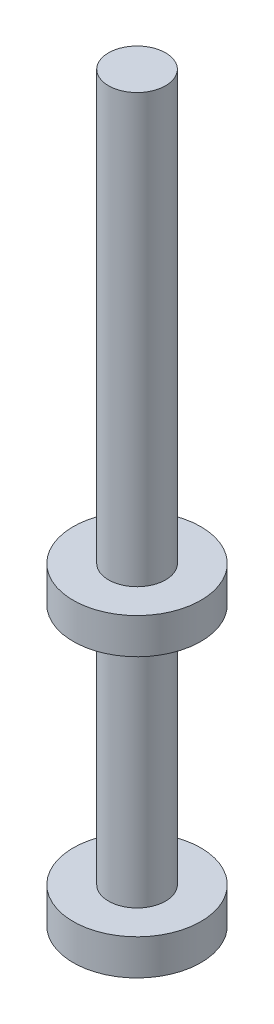
ISO-10303-21;
HEADER;
FILE_DESCRIPTION(('STEP AP214'),'2;1');
FILE_NAME('part.step','',(''),(''),'','','');
FILE_SCHEMA(('AUTOMOTIVE_DESIGN { 1 0 10303 214 1 1 1 1 }'));
ENDSEC;
DATA;
#1=APPLICATION_CONTEXT('core data for automotive mechanical design processes');
#2=APPLICATION_PROTOCOL_DEFINITION('international standard','automotive_design',2000,#1);
#3=PRODUCT_CONTEXT('',#1,'mechanical');
#4=PRODUCT('Part','Part','',(#3));
#5=PRODUCT_RELATED_PRODUCT_CATEGORY('part','',(#4));
#6=PRODUCT_DEFINITION_FORMATION('','',#4);
#7=PRODUCT_DEFINITION_CONTEXT('part definition',#1,'design');
#8=PRODUCT_DEFINITION('design','',#6,#7);
#9=PRODUCT_DEFINITION_SHAPE('','',#8);
#10=(LENGTH_UNIT() NAMED_UNIT(*) SI_UNIT(.MILLI.,.METRE.));
#11=(NAMED_UNIT(*) PLANE_ANGLE_UNIT() SI_UNIT($,.RADIAN.));
#12=(NAMED_UNIT(*) SI_UNIT($,.STERADIAN.) SOLID_ANGLE_UNIT());
#13=UNCERTAINTY_MEASURE_WITH_UNIT(LENGTH_MEASURE(1.E-05),#10,'distance_accuracy_value','');
#14=(GEOMETRIC_REPRESENTATION_CONTEXT(3) GLOBAL_UNCERTAINTY_ASSIGNED_CONTEXT((#13)) GLOBAL_UNIT_ASSIGNED_CONTEXT((#10,
#11,#12)) REPRESENTATION_CONTEXT('',''));
#15=CARTESIAN_POINT('',(0.,0.,0.));
#16=DIRECTION('',(0.,0.,1.));
#17=DIRECTION('',(1.,0.,0.));
#18=AXIS2_PLACEMENT_3D('',#15,#16,#17);
#19=CARTESIAN_POINT('',(0.,75.,0.));
#20=DIRECTION('',(0.,1.,0.));
#21=DIRECTION('',(0.,0.,1.));
#22=AXIS2_PLACEMENT_3D('',#19,#20,#21);
#23=PLANE('',#22);
#24=CARTESIAN_POINT('',(0.,75.,0.));
#25=DIRECTION('',(0.,-1.,0.));
#26=DIRECTION('',(0.,0.,-1.));
#27=AXIS2_PLACEMENT_3D('',#24,#25,#26);
#28=CIRCLE('',#27,3.99999999999999);
#29=CARTESIAN_POINT('',(0.,75.,-3.99999999999999));
#30=VERTEX_POINT('',#29);
#31=EDGE_CURVE('E10',#30,#30,#28,.T.);
#32=ORIENTED_EDGE('',*,*,#31,.F.);
#33=EDGE_LOOP('',(#32));
#34=FACE_BOUND('',#33,.T.);
#35=ADVANCED_FACE('F31',(#34),#23,.T.);
#36=CARTESIAN_POINT('',(0.,0.,0.));
#37=DIRECTION('',(0.,-1.,0.));
#38=DIRECTION('',(0.,0.,-1.));
#39=AXIS2_PLACEMENT_3D('',#36,#37,#38);
#40=CYLINDRICAL_SURFACE('',#39,4.);
#41=ORIENTED_EDGE('',*,*,#31,.T.);
#42=EDGE_LOOP('',(#41));
#43=FACE_BOUND('',#42,.T.);
#44=CARTESIAN_POINT('',(0.,15.,0.));
#45=DIRECTION('',(0.,-1.,0.));
#46=DIRECTION('',(0.,0.,-1.));
#47=AXIS2_PLACEMENT_3D('',#44,#45,#46);
#48=CIRCLE('',#47,4.);
#49=CARTESIAN_POINT('',(0.,15.,-4.));
#50=VERTEX_POINT('',#49);
#51=EDGE_CURVE('E37',#50,#50,#48,.T.);
#52=ORIENTED_EDGE('',*,*,#51,.F.);
#53=EDGE_LOOP('',(#52));
#54=FACE_BOUND('',#53,.T.);
#55=ADVANCED_FACE('F85',(#43,#54),#40,.T.);
#56=CARTESIAN_POINT('',(4.,15.,0.));
#57=DIRECTION('',(0.,1.,0.));
#58=DIRECTION('',(0.,0.,1.));
#59=AXIS2_PLACEMENT_3D('',#56,#57,#58);
#60=PLANE('',#59);
#61=ORIENTED_EDGE('',*,*,#51,.T.);
#62=EDGE_LOOP('',(#61));
#63=FACE_BOUND('',#62,.T.);
#64=CARTESIAN_POINT('',(0.,15.,0.));
#65=DIRECTION('',(0.,-1.,0.));
#66=DIRECTION('',(0.,0.,-1.));
#67=AXIS2_PLACEMENT_3D('',#64,#65,#66);
#68=CIRCLE('',#67,8.95);
#69=CARTESIAN_POINT('',(0.,15.,-8.95));
#70=VERTEX_POINT('',#69);
#71=EDGE_CURVE('E41',#70,#70,#68,.T.);
#72=ORIENTED_EDGE('',*,*,#71,.F.);
#73=EDGE_LOOP('',(#72));
#74=FACE_BOUND('',#73,.T.);
#75=ADVANCED_FACE('F90',(#63,#74),#60,.T.);
#76=CARTESIAN_POINT('',(0.,0.,0.));
#77=DIRECTION('',(0.,-1.,0.));
#78=DIRECTION('',(0.,0.,-1.));
#79=AXIS2_PLACEMENT_3D('',#76,#77,#78);
#80=CYLINDRICAL_SURFACE('',#79,8.95);
#81=ORIENTED_EDGE('',*,*,#71,.T.);
#82=EDGE_LOOP('',(#81));
#83=FACE_BOUND('',#82,.T.);
#84=CARTESIAN_POINT('',(0.,10.,0.));
#85=DIRECTION('',(0.,-1.,0.));
#86=DIRECTION('',(0.,0.,-1.));
#87=AXIS2_PLACEMENT_3D('',#84,#85,#86);
#88=CIRCLE('',#87,8.95);
#89=CARTESIAN_POINT('',(0.,10.,-8.95));
#90=VERTEX_POINT('',#89);
#91=EDGE_CURVE('E45',#90,#90,#88,.T.);
#92=ORIENTED_EDGE('',*,*,#91,.F.);
#93=EDGE_LOOP('',(#92));
#94=FACE_BOUND('',#93,.T.);
#95=ADVANCED_FACE('F94',(#83,#94),#80,.T.);
#96=CARTESIAN_POINT('',(8.95,10.,0.));
#97=DIRECTION('',(0.,-1.,0.));
#98=DIRECTION('',(0.,0.,-1.));
#99=AXIS2_PLACEMENT_3D('',#96,#97,#98);
#100=PLANE('',#99);
#101=ORIENTED_EDGE('',*,*,#91,.T.);
#102=EDGE_LOOP('',(#101));
#103=FACE_BOUND('',#102,.T.);
#104=CARTESIAN_POINT('',(0.,10.,0.));
#105=DIRECTION('',(0.,-1.,0.));
#106=DIRECTION('',(0.,0.,-1.));
#107=AXIS2_PLACEMENT_3D('',#104,#105,#106);
#108=CIRCLE('',#107,4.);
#109=CARTESIAN_POINT('',(0.,10.,-4.));
#110=VERTEX_POINT('',#109);
#111=EDGE_CURVE('E50',#110,#110,#108,.T.);
#112=ORIENTED_EDGE('',*,*,#111,.F.);
#113=EDGE_LOOP('',(#112));
#114=FACE_BOUND('',#113,.T.);
#115=ADVANCED_FACE('F100',(#103,#114),#100,.T.);
#116=CARTESIAN_POINT('',(0.,0.,0.));
#117=DIRECTION('',(0.,-1.,0.));
#118=DIRECTION('',(0.,0.,-1.));
#119=AXIS2_PLACEMENT_3D('',#116,#117,#118);
#120=CYLINDRICAL_SURFACE('',#119,4.);
#121=ORIENTED_EDGE('',*,*,#111,.T.);
#122=EDGE_LOOP('',(#121));
#123=FACE_BOUND('',#122,.T.);
#124=CARTESIAN_POINT('',(0.,-24.,0.));
#125=DIRECTION('',(0.,-1.,0.));
#126=DIRECTION('',(0.,0.,-1.));
#127=AXIS2_PLACEMENT_3D('',#124,#125,#126);
#128=CIRCLE('',#127,4.);
#129=CARTESIAN_POINT('',(0.,-24.,-4.));
#130=VERTEX_POINT('',#129);
#131=EDGE_CURVE('E53',#130,#130,#128,.T.);
#132=ORIENTED_EDGE('',*,*,#131,.F.);
#133=EDGE_LOOP('',(#132));
#134=FACE_BOUND('',#133,.T.);
#135=ADVANCED_FACE('F104',(#123,#134),#120,.T.);
#136=CARTESIAN_POINT('',(4.,-24.,0.));
#137=DIRECTION('',(0.,1.,0.));
#138=DIRECTION('',(0.,0.,1.));
#139=AXIS2_PLACEMENT_3D('',#136,#137,#138);
#140=PLANE('',#139);
#141=ORIENTED_EDGE('',*,*,#131,.T.);
#142=EDGE_LOOP('',(#141));
#143=FACE_BOUND('',#142,.T.);
#144=CARTESIAN_POINT('',(0.,-24.,0.));
#145=DIRECTION('',(0.,-1.,0.));
#146=DIRECTION('',(0.,0.,-1.));
#147=AXIS2_PLACEMENT_3D('',#144,#145,#146);
#148=CIRCLE('',#147,8.95);
#149=CARTESIAN_POINT('',(0.,-24.,-8.95));
#150=VERTEX_POINT('',#149);
#151=EDGE_CURVE('E56',#150,#150,#148,.T.);
#152=ORIENTED_EDGE('',*,*,#151,.F.);
#153=EDGE_LOOP('',(#152));
#154=FACE_BOUND('',#153,.T.);
#155=ADVANCED_FACE('F108',(#143,#154),#140,.T.);
#156=CARTESIAN_POINT('',(0.,0.,0.));
#157=DIRECTION('',(0.,-1.,0.));
#158=DIRECTION('',(0.,0.,-1.));
#159=AXIS2_PLACEMENT_3D('',#156,#157,#158);
#160=CYLINDRICAL_SURFACE('',#159,8.95);
#161=ORIENTED_EDGE('',*,*,#151,.T.);
#162=EDGE_LOOP('',(#161));
#163=FACE_BOUND('',#162,.T.);
#164=CARTESIAN_POINT('',(0.,-29.,0.));
#165=DIRECTION('',(0.,-1.,0.));
#166=DIRECTION('',(0.,0.,-1.));
#167=AXIS2_PLACEMENT_3D('',#164,#165,#166);
#168=CIRCLE('',#167,8.95);
#169=CARTESIAN_POINT('',(0.,-29.,-8.95));
#170=VERTEX_POINT('',#169);
#171=EDGE_CURVE('E59',#170,#170,#168,.T.);
#172=ORIENTED_EDGE('',*,*,#171,.F.);
#173=EDGE_LOOP('',(#172));
#174=FACE_BOUND('',#173,.T.);
#175=ADVANCED_FACE('F81',(#163,#174),#160,.T.);
#176=CARTESIAN_POINT('',(8.95,-29.,0.));
#177=DIRECTION('',(0.,-1.,0.));
#178=DIRECTION('',(0.,0.,-1.));
#179=AXIS2_PLACEMENT_3D('',#176,#177,#178);
#180=PLANE('',#179);
#181=ORIENTED_EDGE('',*,*,#171,.T.);
#182=EDGE_LOOP('',(#181));
#183=FACE_BOUND('',#182,.T.);
#184=CARTESIAN_POINT('',(0.,-29.,0.));
#185=DIRECTION('',(0.,-1.,0.));
#186=DIRECTION('',(0.,0.,-1.));
#187=AXIS2_PLACEMENT_3D('',#184,#185,#186);
#188=CIRCLE('',#187,4.);
#189=CARTESIAN_POINT('',(0.,-29.,-4.));
#190=VERTEX_POINT('',#189);
#191=EDGE_CURVE('E62',#190,#190,#188,.T.);
#192=ORIENTED_EDGE('',*,*,#191,.F.);
#193=EDGE_LOOP('',(#192));
#194=FACE_BOUND('',#193,.T.);
#195=ADVANCED_FACE('F73',(#183,#194),#180,.T.);
#196=CARTESIAN_POINT('',(0.,0.,0.));
#197=DIRECTION('',(0.,-1.,0.));
#198=DIRECTION('',(0.,0.,-1.));
#199=AXIS2_PLACEMENT_3D('',#196,#197,#198);
#200=CYLINDRICAL_SURFACE('',#199,4.00000000000001);
#201=ORIENTED_EDGE('',*,*,#191,.T.);
#202=EDGE_LOOP('',(#201));
#203=FACE_BOUND('',#202,.T.);
#204=CARTESIAN_POINT('',(0.,-31.,0.));
#205=DIRECTION('',(0.,-1.,0.));
#206=DIRECTION('',(0.,0.,-1.));
#207=AXIS2_PLACEMENT_3D('',#204,#205,#206);
#208=CIRCLE('',#207,4.00000000000001);
#209=CARTESIAN_POINT('',(0.,-31.,-4.00000000000001));
#210=VERTEX_POINT('',#209);
#211=EDGE_CURVE('E65',#210,#210,#208,.T.);
#212=ORIENTED_EDGE('',*,*,#211,.F.);
#213=EDGE_LOOP('',(#212));
#214=FACE_BOUND('',#213,.T.);
#215=ADVANCED_FACE('F71',(#203,#214),#200,.T.);
#216=CARTESIAN_POINT('',(4.00000000000001,-31.,0.));
#217=DIRECTION('',(0.,-1.,0.));
#218=DIRECTION('',(0.,0.,-1.));
#219=AXIS2_PLACEMENT_3D('',#216,#217,#218);
#220=PLANE('',#219);
#221=ORIENTED_EDGE('',*,*,#211,.T.);
#222=EDGE_LOOP('',(#221));
#223=FACE_BOUND('',#222,.T.);
#224=ADVANCED_FACE('F69',(#223),#220,.T.);
#225=CLOSED_SHELL('',(#35,#55,#75,#95,#115,#135,#155,#175,#195,#215,#224));
#226=MANIFOLD_SOLID_BREP('B2',#225);
#227=ADVANCED_BREP_SHAPE_REPRESENTATION('',(#18,#226),#14);
#228=SHAPE_DEFINITION_REPRESENTATION(#9,#227);
ENDSEC;
END-ISO-10303-21;
